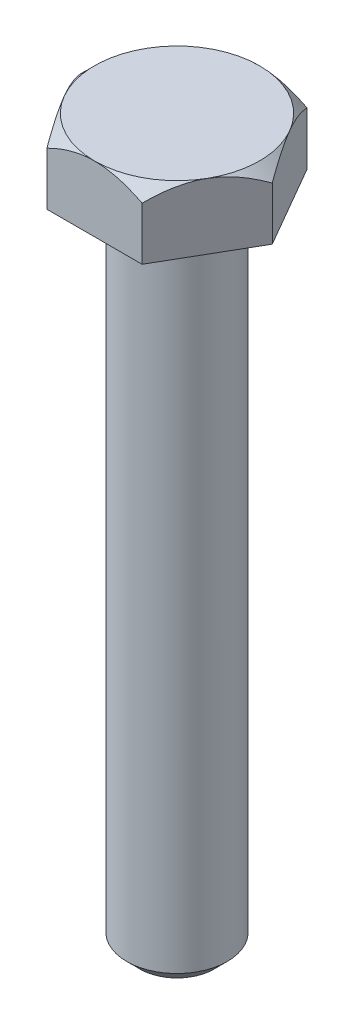
ISO-10303-21;
HEADER;
FILE_DESCRIPTION(('STEP AP214'),'2;1');
FILE_NAME('part.step','',(''),(''),'','','');
FILE_SCHEMA(('AUTOMOTIVE_DESIGN { 1 0 10303 214 1 1 1 1 }'));
ENDSEC;
DATA;
#1=APPLICATION_CONTEXT('core data for automotive mechanical design processes');
#2=APPLICATION_PROTOCOL_DEFINITION('international standard','automotive_design',2000,#1);
#3=PRODUCT_CONTEXT('',#1,'mechanical');
#4=PRODUCT('Part','Part','',(#3));
#5=PRODUCT_RELATED_PRODUCT_CATEGORY('part','',(#4));
#6=PRODUCT_DEFINITION_FORMATION('','',#4);
#7=PRODUCT_DEFINITION_CONTEXT('part definition',#1,'design');
#8=PRODUCT_DEFINITION('design','',#6,#7);
#9=PRODUCT_DEFINITION_SHAPE('','',#8);
#10=(LENGTH_UNIT() NAMED_UNIT(*) SI_UNIT(.MILLI.,.METRE.));
#11=(NAMED_UNIT(*) PLANE_ANGLE_UNIT() SI_UNIT($,.RADIAN.));
#12=(NAMED_UNIT(*) SI_UNIT($,.STERADIAN.) SOLID_ANGLE_UNIT());
#13=UNCERTAINTY_MEASURE_WITH_UNIT(LENGTH_MEASURE(1.E-05),#10,'distance_accuracy_value','');
#14=(GEOMETRIC_REPRESENTATION_CONTEXT(3) GLOBAL_UNCERTAINTY_ASSIGNED_CONTEXT((#13)) GLOBAL_UNIT_ASSIGNED_CONTEXT((#10,
#11,#12)) REPRESENTATION_CONTEXT('',''));
#15=CARTESIAN_POINT('',(0.,0.,0.));
#16=DIRECTION('',(0.,0.,1.));
#17=DIRECTION('',(1.,0.,0.));
#18=AXIS2_PLACEMENT_3D('',#15,#16,#17);
#19=CARTESIAN_POINT('',(3.62500000000007,5.,6.27868417743714));
#20=DIRECTION('',(-0.866025403784442,0.,-0.499999999999995));
#21=DIRECTION('',(-0.499999999999995,0.,0.866025403784442));
#22=AXIS2_PLACEMENT_3D('',#19,#20,#21);
#23=PLANE('',#22);
#24=CARTESIAN_POINT('',(3.62488452994624,4.02856870462476,6.27888417743714));
#25=CARTESIAN_POINT('',(3.68721389664161,4.0908916934917,6.17092654751716));
#26=CARTESIAN_POINT('',(3.75002235616352,4.15130208102734,6.06213910448007));
#27=CARTESIAN_POINT('',(3.87669145105401,4.2677158493395,5.84274179638098));
#28=CARTESIAN_POINT('',(3.94055263837515,4.32371682320785,5.73213097530909));
#29=CARTESIAN_POINT('',(4.13444955410337,4.48471046563524,5.39629166583691));
#30=CARTESIAN_POINT('',(4.26612670995196,4.58200705628878,5.16822014171098));
#31=CARTESIAN_POINT('',(4.53166422082633,4.74862075095615,4.70829568156119));
#32=CARTESIAN_POINT('',(4.66545670737727,4.81835760873348,4.47656029718399));
#33=CARTESIAN_POINT('',(4.86834501872006,4.89902600771869,4.12514743367641));
#34=CARTESIAN_POINT('',(4.93627316062514,4.92191520494596,4.00749244063306));
#35=CARTESIAN_POINT('',(5.07270459498125,4.95919667933445,3.77118626457879));
#36=CARTESIAN_POINT('',(5.14120779992591,4.97359022631844,3.65253523313333));
#37=CARTESIAN_POINT('',(5.30814078917526,4.99772308228725,3.3633988142941));
#38=CARTESIAN_POINT('',(5.40675043702598,5.0027866000747,3.19260189410018));
#39=CARTESIAN_POINT('',(5.60379200256286,4.99428769024785,2.85131589138739));
#40=CARTESIAN_POINT('',(5.70222384583931,4.98071873353769,2.68082693774991));
#41=CARTESIAN_POINT('',(5.89815953180448,4.9357547130673,2.34145637464237));
#42=CARTESIAN_POINT('',(5.99566221252046,4.9043397144273,2.17257677776813));
#43=CARTESIAN_POINT('',(6.18899174051392,4.82539152715257,1.83772021268014));
#44=CARTESIAN_POINT('',(6.28481871570106,4.77785957445157,1.67174302292037));
#45=CARTESIAN_POINT('',(6.45492849942725,4.68007191376467,1.37710423464204));
#46=CARTESIAN_POINT('',(6.52958798795453,4.63238802285783,1.2477902072457));
#47=CARTESIAN_POINT('',(6.67756674436656,4.52933616008443,0.991483482699198));
#48=CARTESIAN_POINT('',(6.75088597153632,4.47396795521828,0.864490856069481));
#49=CARTESIAN_POINT('',(6.89595327454856,4.35678861091045,0.613226916735296));
#50=CARTESIAN_POINT('',(6.96770547617939,4.29499773307909,0.488948457955774));
#51=CARTESIAN_POINT('',(7.10988123305974,4.16578428211806,0.24269282343444));
#52=CARTESIAN_POINT('',(7.18030557110013,4.09836516278837,0.120714291859081));
#53=CARTESIAN_POINT('',(7.25011547005384,4.02856870462477,-0.000200000000000499));
#54=B_SPLINE_CURVE_WITH_KNOTS('',3,(#24,#25,#26,#27,#28,#29,#30,#31,#32,#33,#34,#35,#36,#37,#38,
#39,#40,#41,#42,#43,#44,#45,#46,#47,#48,#49,#50,#51,#52,#53),.UNSPECIFIED.,.F.,.F.,(4,2,2,2,2,2,
2,2,2,2,2,2,2,2,4),(0.,0.418085081925561,0.83639681869771,1.67753646991016,2.50531966073267,
2.91839943514191,3.33141745194524,3.9223507147329,4.51349110216463,5.10529312372582,
5.69704977302065,6.16707290687592,6.63711029563191,7.10570744431351,7.57401912040438),.UNSPECIFIED.);
#55=CARTESIAN_POINT('',(3.62500000000007,4.02868417743718,6.27868417743714));
#56=VERTEX_POINT('',#55);
#57=CARTESIAN_POINT('',(5.43750000000002,5.,3.13934208871856));
#58=VERTEX_POINT('',#57);
#59=EDGE_CURVE('E110',#56,#58,#54,.T.);
#60=ORIENTED_EDGE('',*,*,#59,.F.);
#61=DIRECTION('',(0.,-1.,0.));
#62=VECTOR('',#61,1.);
#63=CARTESIAN_POINT('',(3.62500000000007,5.,6.27868417743714));
#64=LINE('',#63,#62);
#65=CARTESIAN_POINT('',(3.62500000000007,0.,6.27868417743714));
#66=VERTEX_POINT('',#65);
#67=EDGE_CURVE('E59',#56,#66,#64,.T.);
#68=ORIENTED_EDGE('',*,*,#67,.T.);
#69=DIRECTION('',(0.499999999999995,0.,-0.866025403784442));
#70=VECTOR('',#69,1.);
#71=CARTESIAN_POINT('',(3.62500000000007,0.,6.27868417743714));
#72=LINE('',#71,#70);
#73=CARTESIAN_POINT('',(7.25,0.,0.));
#74=VERTEX_POINT('',#73);
#75=EDGE_CURVE('E117',#66,#74,#72,.T.);
#76=ORIENTED_EDGE('',*,*,#75,.T.);
#77=DIRECTION('',(0.,-1.,0.));
#78=VECTOR('',#77,1.);
#79=CARTESIAN_POINT('',(7.25,5.,0.));
#80=LINE('',#79,#78);
#81=CARTESIAN_POINT('',(7.25,4.02868417743718,0.));
#82=VERTEX_POINT('',#81);
#83=EDGE_CURVE('E135',#82,#74,#80,.T.);
#84=ORIENTED_EDGE('',*,*,#83,.F.);
#85=EDGE_CURVE('E118',#58,#82,#54,.T.);
#86=ORIENTED_EDGE('',*,*,#85,.F.);
#87=EDGE_LOOP('',(#60,#68,#76,#84,#86));
#88=FACE_BOUND('',#87,.T.);
#89=ADVANCED_FACE('F36',(#88),#23,.F.);
#90=CARTESIAN_POINT('',(7.25,5.,0.));
#91=DIRECTION('',(-0.866025403784438,0.,0.500000000000001));
#92=DIRECTION('',(0.500000000000001,0.,0.866025403784438));
#93=AXIS2_PLACEMENT_3D('',#90,#91,#92);
#94=PLANE('',#93);
#95=CARTESIAN_POINT('',(7.25011547005384,4.02856870462477,0.000200000000000034));
#96=CARTESIAN_POINT('',(7.18778610335847,4.0908916934917,-0.107757629919975));
#97=CARTESIAN_POINT('',(7.12497764383655,4.15130208102734,-0.21654507295707));
#98=CARTESIAN_POINT('',(6.99830854894606,4.2677158493395,-0.435942381056166));
#99=CARTESIAN_POINT('',(6.93444736162492,4.32371682320785,-0.546553202128054));
#100=CARTESIAN_POINT('',(6.7405504458967,4.48471046563526,-0.882392511600232));
#101=CARTESIAN_POINT('',(6.6088732900481,4.58200705628879,-1.11046403572617));
#102=CARTESIAN_POINT('',(6.34333577917372,4.74862075095617,-1.57038849587596));
#103=CARTESIAN_POINT('',(6.20954329262278,4.8183576087335,-1.80212388025316));
#104=CARTESIAN_POINT('',(6.00665498127998,4.89902600771871,-2.15353674376074));
#105=CARTESIAN_POINT('',(5.9387268393749,4.92191520494598,-2.27119173680409));
#106=CARTESIAN_POINT('',(5.80229540501879,4.95919667933447,-2.50749791285837));
#107=CARTESIAN_POINT('',(5.73379220007413,4.97359022631846,-2.62614894430383));
#108=CARTESIAN_POINT('',(5.56685921082478,4.99772308228727,-2.91528536314305));
#109=CARTESIAN_POINT('',(5.46824956297406,5.00278660007473,-3.08608228333698));
#110=CARTESIAN_POINT('',(5.27120799743718,4.99428769024788,-3.42736828604976));
#111=CARTESIAN_POINT('',(5.17277615416072,4.98071873353772,-3.59785723968724));
#112=CARTESIAN_POINT('',(4.97684046819555,4.93575471306732,-3.93722780279478));
#113=CARTESIAN_POINT('',(4.87933778747957,4.90433971442733,-4.10610739966901));
#114=CARTESIAN_POINT('',(4.68600825948611,4.8253915271526,-4.44096396475701));
#115=CARTESIAN_POINT('',(4.59018128429897,4.7778595744516,-4.60694115451677));
#116=CARTESIAN_POINT('',(4.42007150057277,4.68007191376469,-4.9015799427951));
#117=CARTESIAN_POINT('',(4.34541201204549,4.63238802285786,-5.03089397019145));
#118=CARTESIAN_POINT('',(4.19743325563346,4.52933616008445,-5.28720069473796));
#119=CARTESIAN_POINT('',(4.12411402846369,4.4739679552183,-5.41419332136768));
#120=CARTESIAN_POINT('',(3.97904672545145,4.35678861091046,-5.66545726070187));
#121=CARTESIAN_POINT('',(3.90729452382061,4.2949977330791,-5.7897357194814));
#122=CARTESIAN_POINT('',(3.76511876694025,4.16578428211807,-6.03599135400274));
#123=CARTESIAN_POINT('',(3.69469442889986,4.09836516278837,-6.1579698855781));
#124=CARTESIAN_POINT('',(3.62488452994615,4.02856870462476,-6.27888417743719));
#125=B_SPLINE_CURVE_WITH_KNOTS('',3,(#95,#96,#97,#98,#99,#100,#101,#102,#103,#104,#105,#106,
#107,#108,#109,#110,#111,#112,#113,#114,#115,#116,#117,#118,#119,#120,#121,#122,#123,#124),
.UNSPECIFIED.,.F.,.F.,(4,2,2,2,2,2,2,2,2,2,2,2,2,2,4),(0.,0.418085081925567,0.83639681869772,
1.67753646991019,2.5053196607327,2.91839943514195,3.33141745194528,3.92235071473293,
4.51349110216466,5.10529312372585,5.69704977302068,6.16707290687597,6.63711029563198,
7.1057074443136,7.57401912040448),.UNSPECIFIED.);
#126=CARTESIAN_POINT('',(5.43749999999999,5.,-3.13934208871859));
#127=VERTEX_POINT('',#126);
#128=EDGE_CURVE('E125',#82,#127,#125,.T.);
#129=ORIENTED_EDGE('',*,*,#128,.F.);
#130=ORIENTED_EDGE('',*,*,#83,.T.);
#131=DIRECTION('',(-0.500000000000001,0.,-0.866025403784438));
#132=VECTOR('',#131,1.);
#133=CARTESIAN_POINT('',(7.25,0.,0.));
#134=LINE('',#133,#132);
#135=CARTESIAN_POINT('',(3.62499999999999,0.,-6.27868417743719));
#136=VERTEX_POINT('',#135);
#137=EDGE_CURVE('E398',#74,#136,#134,.T.);
#138=ORIENTED_EDGE('',*,*,#137,.T.);
#139=DIRECTION('',(0.,-1.,0.));
#140=VECTOR('',#139,1.);
#141=CARTESIAN_POINT('',(3.62499999999999,5.,-6.27868417743719));
#142=LINE('',#141,#140);
#143=CARTESIAN_POINT('',(3.62499999999999,4.02868417743718,-6.27868417743719));
#144=VERTEX_POINT('',#143);
#145=EDGE_CURVE('E204',#144,#136,#142,.T.);
#146=ORIENTED_EDGE('',*,*,#145,.F.);
#147=EDGE_CURVE('E136',#127,#144,#125,.T.);
#148=ORIENTED_EDGE('',*,*,#147,.F.);
#149=EDGE_LOOP('',(#129,#130,#138,#146,#148));
#150=FACE_BOUND('',#149,.T.);
#151=ADVANCED_FACE('F192',(#150),#94,.F.);
#152=CARTESIAN_POINT('',(3.62499999999999,5.,-6.27868417743719));
#153=DIRECTION('',(0.,0.,1.));
#154=DIRECTION('',(1.,0.,0.));
#155=AXIS2_PLACEMENT_3D('',#152,#153,#154);
#156=PLANE('',#155);
#157=CARTESIAN_POINT('',(-7.57666051860033,1.43857952280487,-6.27868417743715));
#158=CARTESIAN_POINT('',(-7.39365651230783,1.57945688959872,-6.27868417743715));
#159=CARTESIAN_POINT('',(-7.20966776392706,1.71907512434262,-6.27868417743715));
#160=CARTESIAN_POINT('',(-6.83931781583867,1.99521769306877,-6.27868417743715));
#161=CARTESIAN_POINT('',(-6.65295606622731,2.13174128876494,-6.27868417743715));
#162=CARTESIAN_POINT('',(-6.27609540777261,2.40209046760801,-6.27868417743715));
#163=CARTESIAN_POINT('',(-6.08557567548029,2.53588711812094,-6.27868417743715));
#164=CARTESIAN_POINT('',(-5.7013676758548,2.79883528544532,-6.27868417743716));
#165=CARTESIAN_POINT('',(-5.50767962786199,2.92798712185071,-6.27868417743716));
#166=CARTESIAN_POINT('',(-5.10415932230891,3.18862292545138,-6.27868417743716));
#167=CARTESIAN_POINT('',(-4.89408397797518,3.31973242959604,-6.27868417743716));
#168=CARTESIAN_POINT('',(-4.46899924146733,3.57382963916996,-6.27868417743716));
#169=CARTESIAN_POINT('',(-4.25398902548427,3.69681597506302,-6.27868417743716));
#170=CARTESIAN_POINT('',(-3.81897305439861,3.93204888921299,-6.27868417743716));
#171=CARTESIAN_POINT('',(-3.59898447967616,4.04432699068524,-6.27868417743716));
#172=CARTESIAN_POINT('',(-3.15278127156474,4.25562782816849,-6.27868417743717));
#173=CARTESIAN_POINT('',(-2.92656964053751,4.35465682564157,-6.27868417743717));
#174=CARTESIAN_POINT('',(-2.49021164331831,4.52687246842811,-6.27868417743717));
#175=CARTESIAN_POINT('',(-2.28069897147736,4.60164844585029,-6.27868417743717));
#176=CARTESIAN_POINT('',(-1.85632597962451,4.73443118921241,-6.27868417743717));
#177=CARTESIAN_POINT('',(-1.64146532079161,4.79243688972169,-6.27868417743717));
#178=CARTESIAN_POINT('',(-1.21142765694939,4.8875683886695,-6.27868417743717));
#179=CARTESIAN_POINT('',(-0.996336148218653,4.9250741683904,-6.27868417743717));
#180=CARTESIAN_POINT('',(-0.56346815275014,4.97842167925469,-6.27868417743717));
#181=CARTESIAN_POINT('',(-0.345692236177016,4.99426793349426,-6.27868417743717));
#182=CARTESIAN_POINT('',(0.0807362217716663,5.0029407360174,-6.27868417743718));
#183=CARTESIAN_POINT('',(0.289368982497101,4.99674859993676,-6.27868417743718));
#184=CARTESIAN_POINT('',(0.705011615215947,4.96394190845027,-6.27868417743718));
#185=CARTESIAN_POINT('',(0.912021338466265,4.9373255028629,-6.27868417743718));
#186=CARTESIAN_POINT('',(1.3264284221839,4.86472465401487,-6.27868417743718));
#187=CARTESIAN_POINT('',(1.53376477368789,4.81839783409703,-6.27868417743718));
#188=CARTESIAN_POINT('',(1.94386969783723,4.70894974197332,-6.27868417743718));
#189=CARTESIAN_POINT('',(2.14663852486609,4.64582940758558,-6.27868417743718));
#190=CARTESIAN_POINT('',(2.55855272468635,4.5016094654899,-6.27868417743719));
#191=CARTESIAN_POINT('',(2.76740928890636,4.41969434988626,-6.27868417743719));
#192=CARTESIAN_POINT('',(3.17975166734441,4.24320663783212,-6.27868417743719));
#193=CARTESIAN_POINT('',(3.38323501259331,4.14862833983322,-6.27868417743719));
#194=CARTESIAN_POINT('',(3.78579095692702,3.94905699505205,-6.27868417743719));
#195=CARTESIAN_POINT('',(3.98484753290937,3.84403189037483,-6.27868417743719));
#196=CARTESIAN_POINT('',(4.37839993765141,3.62587782327072,-6.27868417743719));
#197=CARTESIAN_POINT('',(4.57289646186356,3.51275010738356,-6.27868417743719));
#198=CARTESIAN_POINT('',(4.94842033299621,3.28571869098054,-6.27868417743719));
#199=CARTESIAN_POINT('',(5.12963857253774,3.17212907012057,-6.27868417743719));
#200=CARTESIAN_POINT('',(5.48896153359933,2.94011331347926,-6.2786841774372));
#201=CARTESIAN_POINT('',(5.66706602033122,2.82168681520702,-6.2786841774372));
#202=CARTESIAN_POINT('',(6.01913728036014,2.5818234603211,-6.2786841774372));
#203=CARTESIAN_POINT('',(6.19312579011556,2.46041839375126,-6.2786841774372));
#204=CARTESIAN_POINT('',(6.5387156854476,2.2143526316317,-6.2786841774372));
#205=CARTESIAN_POINT('',(6.71031771587599,2.08969284280949,-6.2786841774372));
#206=CARTESIAN_POINT('',(6.88091860823282,1.96370076934005,-6.2786841774372));
#207=B_SPLINE_CURVE_WITH_KNOTS('',3,(#157,#158,#159,#160,#161,#162,#163,#164,#165,#166,#167,
#168,#169,#170,#171,#172,#173,#174,#175,#176,#177,#178,#179,#180,#181,#182,#183,#184,#185,#186,
#187,#188,#189,#190,#191,#192,#193,#194,#195,#196,#197,#198,#199,#200,#201,#202,#203,#204,#205,
#206),.UNSPECIFIED.,.F.,.F.,(4,2,2,2,2,2,2,2,2,2,2,2,2,2,2,2,2,2,2,2,2,2,2,2,4),(0.,
0.692856158772512,1.38587590819399,2.0842410666755,2.78255808072084,3.52530650890354,
4.26817984375935,5.00879403011467,5.74905696003691,6.41585238613356,7.08269016503529,
7.73670784074358,8.39058891895184,9.01572562815278,9.64091897355062,10.2774464921539,
10.9139384719306,11.586461232698,12.2592878189047,12.9342468231889,13.6091022110665,
14.2506381722582,14.8922223007264,15.5286570401769,16.1649163294069),.UNSPECIFIED.);
#208=CARTESIAN_POINT('',(0.,5.,-6.27868417743718));
#209=VERTEX_POINT('',#208);
#210=EDGE_CURVE('E186',#144,#209,#207,.F.);
#211=ORIENTED_EDGE('',*,*,#210,.F.);
#212=ORIENTED_EDGE('',*,*,#145,.T.);
#213=DIRECTION('',(-1.,0.,0.));
#214=VECTOR('',#213,1.);
#215=CARTESIAN_POINT('',(3.62499999999999,0.,-6.27868417743719));
#216=LINE('',#215,#214);
#217=CARTESIAN_POINT('',(-3.62500000000003,0.,-6.27868417743716));
#218=VERTEX_POINT('',#217);
#219=EDGE_CURVE('E222',#136,#218,#216,.T.);
#220=ORIENTED_EDGE('',*,*,#219,.T.);
#221=DIRECTION('',(0.,-1.,0.));
#222=VECTOR('',#221,1.);
#223=CARTESIAN_POINT('',(-3.62500000000003,5.,-6.27868417743716));
#224=LINE('',#223,#222);
#225=CARTESIAN_POINT('',(-3.62500000000003,4.02868417743718,-6.27868417743716));
#226=VERTEX_POINT('',#225);
#227=EDGE_CURVE('E220',#226,#218,#224,.T.);
#228=ORIENTED_EDGE('',*,*,#227,.F.);
#229=EDGE_CURVE('E181',#209,#226,#207,.F.);
#230=ORIENTED_EDGE('',*,*,#229,.F.);
#231=EDGE_LOOP('',(#211,#212,#220,#228,#230));
#232=FACE_BOUND('',#231,.T.);
#233=ADVANCED_FACE('F188',(#232),#156,.F.);
#234=CARTESIAN_POINT('',(-3.62500000000003,5.,-6.27868417743716));
#235=DIRECTION('',(0.866025403784442,0.,0.499999999999995));
#236=DIRECTION('',(0.499999999999995,0.,-0.866025403784442));
#237=AXIS2_PLACEMENT_3D('',#234,#235,#236);
#238=PLANE('',#237);
#239=CARTESIAN_POINT('',(-3.62488452994619,4.02856870462477,-6.27888417743716));
#240=CARTESIAN_POINT('',(-3.68721389664156,4.0908916934917,-6.17092654751719));
#241=CARTESIAN_POINT('',(-3.75002235616348,4.15130208102734,-6.06213910448009));
#242=CARTESIAN_POINT('',(-3.87669145105397,4.2677158493395,-5.842741796381));
#243=CARTESIAN_POINT('',(-3.94055263837511,4.32371682320785,-5.73213097530911));
#244=CARTESIAN_POINT('',(-4.13444955410333,4.48471046563526,-5.39629166583693));
#245=CARTESIAN_POINT('',(-4.26612670995192,4.58200705628879,-5.16822014171099));
#246=CARTESIAN_POINT('',(-4.5316642208263,4.74862075095617,-4.7082956815612));
#247=CARTESIAN_POINT('',(-4.66545670737723,4.8183576087335,-4.476560297184));
#248=CARTESIAN_POINT('',(-4.86834501872003,4.89902600771871,-4.12514743367642));
#249=CARTESIAN_POINT('',(-4.93627316062511,4.92191520494598,-4.00749244063306));
#250=CARTESIAN_POINT('',(-5.07270459498122,4.95919667933447,-3.77118626457879));
#251=CARTESIAN_POINT('',(-5.14120779992588,4.97359022631847,-3.65253523313333));
#252=CARTESIAN_POINT('',(-5.30814078917523,4.99772308228727,-3.3633988142941));
#253=CARTESIAN_POINT('',(-5.40675043702595,5.00278660007473,-3.19260189410018));
#254=CARTESIAN_POINT('',(-5.60379200256283,4.99428769024788,-2.85131589138739));
#255=CARTESIAN_POINT('',(-5.70222384583928,4.98071873353772,-2.68082693774991));
#256=CARTESIAN_POINT('',(-5.89815953180445,4.93575471306732,-2.34145637464237));
#257=CARTESIAN_POINT('',(-5.99566221252043,4.90433971442733,-2.17257677776813));
#258=CARTESIAN_POINT('',(-6.18899174051389,4.8253915271526,-1.83772021268014));
#259=CARTESIAN_POINT('',(-6.28481871570103,4.7778595744516,-1.67174302292038));
#260=CARTESIAN_POINT('',(-6.45492849942722,4.68007191376469,-1.37710423464204));
#261=CARTESIAN_POINT('',(-6.5295879879545,4.63238802285786,-1.24779020724569));
#262=CARTESIAN_POINT('',(-6.67756674436654,4.52933616008446,-0.991483482699183));
#263=CARTESIAN_POINT('',(-6.7508859715363,4.4739679552183,-0.864490856069462));
#264=CARTESIAN_POINT('',(-6.89595327454855,4.35678861091046,-0.613226916735267));
#265=CARTESIAN_POINT('',(-6.96770547617938,4.2949977330791,-0.488948457955741));
#266=CARTESIAN_POINT('',(-7.10988123305973,4.16578428211807,-0.242692823434398));
#267=CARTESIAN_POINT('',(-7.18030557110012,4.09836516278837,-0.120714291859035));
#268=CARTESIAN_POINT('',(-7.25011547005384,4.02856870462476,0.000200000000050344));
#269=B_SPLINE_CURVE_WITH_KNOTS('',3,(#239,#240,#241,#242,#243,#244,#245,#246,#247,#248,#249,
#250,#251,#252,#253,#254,#255,#256,#257,#258,#259,#260,#261,#262,#263,#264,#265,#266,#267,#268),
.UNSPECIFIED.,.F.,.F.,(4,2,2,2,2,2,2,2,2,2,2,2,2,2,4),(0.,0.418085081925566,0.836396818697719,
1.67753646991018,2.5053196607327,2.91839943514195,3.33141745194527,3.92235071473293,
4.51349110216466,5.10529312372584,5.69704977302067,6.16707290687597,6.63711029563198,
7.1057074443136,7.57401912040448),.UNSPECIFIED.);
#270=CARTESIAN_POINT('',(-5.43750000000001,5.,-3.13934208871856));
#271=VERTEX_POINT('',#270);
#272=EDGE_CURVE('E187',#226,#271,#269,.T.);
#273=ORIENTED_EDGE('',*,*,#272,.F.);
#274=ORIENTED_EDGE('',*,*,#227,.T.);
#275=DIRECTION('',(-0.499999999999995,0.,0.866025403784441));
#276=VECTOR('',#275,1.);
#277=CARTESIAN_POINT('',(-3.62500000000003,0.,-6.27868417743716));
#278=LINE('',#277,#276);
#279=CARTESIAN_POINT('',(-7.25,0.,0.));
#280=VERTEX_POINT('',#279);
#281=EDGE_CURVE('E396',#218,#280,#278,.T.);
#282=ORIENTED_EDGE('',*,*,#281,.T.);
#283=DIRECTION('',(0.,-1.,0.));
#284=VECTOR('',#283,1.);
#285=CARTESIAN_POINT('',(-7.25,5.,0.));
#286=LINE('',#285,#284);
#287=CARTESIAN_POINT('',(-7.25,4.02868417743718,0.));
#288=VERTEX_POINT('',#287);
#289=EDGE_CURVE('E226',#288,#280,#286,.T.);
#290=ORIENTED_EDGE('',*,*,#289,.F.);
#291=EDGE_CURVE('E176',#271,#288,#269,.T.);
#292=ORIENTED_EDGE('',*,*,#291,.F.);
#293=EDGE_LOOP('',(#273,#274,#282,#290,#292));
#294=FACE_BOUND('',#293,.T.);
#295=ADVANCED_FACE('F191',(#294),#238,.F.);
#296=CARTESIAN_POINT('',(-7.25,5.,0.));
#297=DIRECTION('',(0.866025403784435,0.,-0.500000000000007));
#298=DIRECTION('',(-0.500000000000007,0.,-0.866025403784435));
#299=AXIS2_PLACEMENT_3D('',#296,#297,#298);
#300=PLANE('',#299);
#301=CARTESIAN_POINT('',(-7.25011547005384,4.02856870462477,-0.000199999999949406));
#302=CARTESIAN_POINT('',(-7.18778610335847,4.0908916934917,0.107757629920025));
#303=CARTESIAN_POINT('',(-7.12497764383655,4.15130208102734,0.216545072957119));
#304=CARTESIAN_POINT('',(-6.99830854894605,4.2677158493395,0.435942381056215));
#305=CARTESIAN_POINT('',(-6.93444736162491,4.32371682320785,0.546553202128102));
#306=CARTESIAN_POINT('',(-6.74055044589669,4.48471046563525,0.882392511600279));
#307=CARTESIAN_POINT('',(-6.60887329004809,4.58200705628879,1.11046403572621));
#308=CARTESIAN_POINT('',(-6.34333577917371,4.74862075095617,1.570388495876));
#309=CARTESIAN_POINT('',(-6.20954329262277,4.8183576087335,1.8021238802532));
#310=CARTESIAN_POINT('',(-6.00665498127997,4.89902600771871,2.15353674376078));
#311=CARTESIAN_POINT('',(-5.93872683937489,4.92191520494598,2.27119173680413));
#312=CARTESIAN_POINT('',(-5.80229540501878,4.95919667933447,2.50749791285841));
#313=CARTESIAN_POINT('',(-5.73379220007411,4.97359022631847,2.62614894430387));
#314=CARTESIAN_POINT('',(-5.56685921082476,4.99772308228727,2.91528536314309));
#315=CARTESIAN_POINT('',(-5.46824956297404,5.00278660007473,3.08608228333701));
#316=CARTESIAN_POINT('',(-5.27120799743715,4.99428769024788,3.4273682860498));
#317=CARTESIAN_POINT('',(-5.1727761541607,4.98071873353772,3.59785723968728));
#318=CARTESIAN_POINT('',(-4.97684046819552,4.93575471306732,3.93722780279481));
#319=CARTESIAN_POINT('',(-4.87933778747955,4.90433971442733,4.10610739966905));
#320=CARTESIAN_POINT('',(-4.68600825948608,4.8253915271526,4.44096396475704));
#321=CARTESIAN_POINT('',(-4.59018128429894,4.7778595744516,4.6069411545168));
#322=CARTESIAN_POINT('',(-4.42007150057274,4.68007191376469,4.90157994279513));
#323=CARTESIAN_POINT('',(-4.34541201204546,4.63238802285786,5.03089397019148));
#324=CARTESIAN_POINT('',(-4.19743325563342,4.52933616008446,5.28720069473799));
#325=CARTESIAN_POINT('',(-4.12411402846365,4.4739679552183,5.41419332136771));
#326=CARTESIAN_POINT('',(-3.9790467254514,4.35678861091047,5.6654572607019));
#327=CARTESIAN_POINT('',(-3.90729452382057,4.2949977330791,5.78973571948143));
#328=CARTESIAN_POINT('',(-3.76511876694021,4.16578428211807,6.03599135400277));
#329=CARTESIAN_POINT('',(-3.69469442889982,4.09836516278837,6.15796988557813));
#330=CARTESIAN_POINT('',(-3.6248845299461,4.02856870462477,6.27888417743721));
#331=B_SPLINE_CURVE_WITH_KNOTS('',3,(#301,#302,#303,#304,#305,#306,#307,#308,#309,#310,#311,
#312,#313,#314,#315,#316,#317,#318,#319,#320,#321,#322,#323,#324,#325,#326,#327,#328,#329,#330),
.UNSPECIFIED.,.F.,.F.,(4,2,2,2,2,2,2,2,2,2,2,2,2,2,4),(0.,0.418085081925566,0.836396818697719,
1.67753646991019,2.50531966073269,2.91839943514195,3.33141745194527,3.92235071473293,
4.51349110216466,5.10529312372585,5.69704977302068,6.16707290687597,6.63711029563198,
7.1057074443136,7.57401912040449),.UNSPECIFIED.);
#332=CARTESIAN_POINT('',(-5.43749999999997,5.,3.13934208871863));
#333=VERTEX_POINT('',#332);
#334=EDGE_CURVE('E381',#288,#333,#331,.T.);
#335=ORIENTED_EDGE('',*,*,#334,.F.);
#336=ORIENTED_EDGE('',*,*,#289,.T.);
#337=DIRECTION('',(0.500000000000007,0.,0.866025403784434));
#338=VECTOR('',#337,1.);
#339=CARTESIAN_POINT('',(-7.25,0.,0.));
#340=LINE('',#339,#338);
#341=CARTESIAN_POINT('',(-3.62499999999994,0.,6.27868417743721));
#342=VERTEX_POINT('',#341);
#343=EDGE_CURVE('E389',#280,#342,#340,.T.);
#344=ORIENTED_EDGE('',*,*,#343,.T.);
#345=DIRECTION('',(0.,-1.,0.));
#346=VECTOR('',#345,1.);
#347=CARTESIAN_POINT('',(-3.62499999999994,5.,6.27868417743721));
#348=LINE('',#347,#346);
#349=CARTESIAN_POINT('',(-3.62499999999994,4.02868417743718,6.27868417743721));
#350=VERTEX_POINT('',#349);
#351=EDGE_CURVE('E229',#350,#342,#348,.T.);
#352=ORIENTED_EDGE('',*,*,#351,.F.);
#353=EDGE_CURVE('E169',#333,#350,#331,.T.);
#354=ORIENTED_EDGE('',*,*,#353,.F.);
#355=EDGE_LOOP('',(#335,#336,#344,#352,#354));
#356=FACE_BOUND('',#355,.T.);
#357=ADVANCED_FACE('F309',(#356),#300,.F.);
#358=CARTESIAN_POINT('',(-3.62499999999994,5.,6.27868417743721));
#359=DIRECTION('',(0.,0.,-1.));
#360=DIRECTION('',(-1.,0.,0.));
#361=AXIS2_PLACEMENT_3D('',#358,#359,#360);
#362=PLANE('',#361);
#363=CARTESIAN_POINT('',(-7.57666051860024,1.43857952280487,6.27868417743725));
#364=CARTESIAN_POINT('',(-7.39365651230774,1.57945688959872,6.27868417743725));
#365=CARTESIAN_POINT('',(-7.20966776392697,1.71907512434262,6.27868417743725));
#366=CARTESIAN_POINT('',(-6.83931781583858,1.99521769306878,6.27868417743725));
#367=CARTESIAN_POINT('',(-6.65295606622722,2.13174128876494,6.27868417743725));
#368=CARTESIAN_POINT('',(-6.27609540777252,2.40209046760801,6.27868417743724));
#369=CARTESIAN_POINT('',(-6.0855756754802,2.53588711812094,6.27868417743724));
#370=CARTESIAN_POINT('',(-5.70136767585471,2.79883528544532,6.27868417743724));
#371=CARTESIAN_POINT('',(-5.50767962786191,2.92798712185071,6.27868417743723));
#372=CARTESIAN_POINT('',(-5.10415932230883,3.18862292545138,6.27868417743723));
#373=CARTESIAN_POINT('',(-4.89408397797509,3.31973242959604,6.27868417743723));
#374=CARTESIAN_POINT('',(-4.46899924146725,3.57382963916996,6.27868417743722));
#375=CARTESIAN_POINT('',(-4.25398902548418,3.69681597506302,6.27868417743722));
#376=CARTESIAN_POINT('',(-3.81897305439853,3.93204888921299,6.27868417743722));
#377=CARTESIAN_POINT('',(-3.59898447967608,4.04432699068524,6.27868417743721));
#378=CARTESIAN_POINT('',(-3.15278127156466,4.25562782816848,6.27868417743721));
#379=CARTESIAN_POINT('',(-2.92656964053743,4.35465682564157,6.27868417743721));
#380=CARTESIAN_POINT('',(-2.49021164331822,4.52687246842811,6.2786841774372));
#381=CARTESIAN_POINT('',(-2.28069897147728,4.60164844585029,6.2786841774372));
#382=CARTESIAN_POINT('',(-1.85632597962443,4.73443118921241,6.2786841774372));
#383=CARTESIAN_POINT('',(-1.64146532079152,4.79243688972169,6.27868417743719));
#384=CARTESIAN_POINT('',(-1.2114276569493,4.8875683886695,6.27868417743719));
#385=CARTESIAN_POINT('',(-0.996336148218567,4.9250741683904,6.27868417743719));
#386=CARTESIAN_POINT('',(-0.563468152750053,4.97842167925468,6.27868417743718));
#387=CARTESIAN_POINT('',(-0.345692236176929,4.99426793349426,6.27868417743718));
#388=CARTESIAN_POINT('',(0.0807362217717539,5.00294073601741,6.27868417743718));
#389=CARTESIAN_POINT('',(0.289368982497189,4.99674859993676,6.27868417743717));
#390=CARTESIAN_POINT('',(0.705011615216036,4.96394190845027,6.27868417743717));
#391=CARTESIAN_POINT('',(0.912021338466354,4.9373255028629,6.27868417743717));
#392=CARTESIAN_POINT('',(1.32642842218399,4.86472465401487,6.27868417743716));
#393=CARTESIAN_POINT('',(1.53376477368798,4.81839783409703,6.27868417743716));
#394=CARTESIAN_POINT('',(1.94386969783732,4.70894974197332,6.27868417743716));
#395=CARTESIAN_POINT('',(2.14663852486618,4.64582940758559,6.27868417743715));
#396=CARTESIAN_POINT('',(2.55855272468644,4.5016094654899,6.27868417743715));
#397=CARTESIAN_POINT('',(2.76740928890645,4.41969434988626,6.27868417743715));
#398=CARTESIAN_POINT('',(3.1797516673445,4.24320663783212,6.27868417743714));
#399=CARTESIAN_POINT('',(3.3832350125934,4.14862833983321,6.27868417743714));
#400=CARTESIAN_POINT('',(3.78579095692711,3.94905699505205,6.27868417743714));
#401=CARTESIAN_POINT('',(3.98484753290946,3.84403189037483,6.27868417743714));
#402=CARTESIAN_POINT('',(4.3783999376515,3.62587782327071,6.27868417743713));
#403=CARTESIAN_POINT('',(4.57289646186365,3.51275010738355,6.27868417743713));
#404=CARTESIAN_POINT('',(4.9484203329963,3.28571869098054,6.27868417743713));
#405=CARTESIAN_POINT('',(5.12963857253784,3.17212907012056,6.27868417743712));
#406=CARTESIAN_POINT('',(5.48896153359942,2.94011331347926,6.27868417743712));
#407=CARTESIAN_POINT('',(5.66706602033131,2.82168681520701,6.27868417743712));
#408=CARTESIAN_POINT('',(6.01913728036024,2.58182346032109,6.27868417743711));
#409=CARTESIAN_POINT('',(6.19312579011566,2.46041839375125,6.27868417743711));
#410=CARTESIAN_POINT('',(6.5387156854477,2.21435263163169,6.27868417743711));
#411=CARTESIAN_POINT('',(6.71031771587608,2.08969284280948,6.27868417743711));
#412=CARTESIAN_POINT('',(6.88091860823291,1.96370076934005,6.27868417743711));
#413=B_SPLINE_CURVE_WITH_KNOTS('',3,(#363,#364,#365,#366,#367,#368,#369,#370,#371,#372,#373,
#374,#375,#376,#377,#378,#379,#380,#381,#382,#383,#384,#385,#386,#387,#388,#389,#390,#391,#392,
#393,#394,#395,#396,#397,#398,#399,#400,#401,#402,#403,#404,#405,#406,#407,#408,#409,#410,#411,
#412),.UNSPECIFIED.,.F.,.F.,(4,2,2,2,2,2,2,2,2,2,2,2,2,2,2,2,2,2,2,2,2,2,2,2,4),(0.,
0.692856158772512,1.38587590819398,2.0842410666755,2.78255808072084,3.52530650890354,
4.26817984375935,5.00879403011467,5.7490569600369,6.41585238613355,7.08269016503529,
7.73670784074358,8.39058891895183,9.01572562815278,9.64091897355062,10.2774464921539,
10.9139384719306,11.586461232698,12.2592878189047,12.9342468231889,13.6091022110665,
14.2506381722582,14.8922223007265,15.5286570401769,16.1649163294069),.UNSPECIFIED.);
#414=CARTESIAN_POINT('',(0.,5.,6.27868417743717));
#415=VERTEX_POINT('',#414);
#416=EDGE_CURVE('E383',#350,#415,#413,.T.);
#417=ORIENTED_EDGE('',*,*,#416,.F.);
#418=ORIENTED_EDGE('',*,*,#351,.T.);
#419=DIRECTION('',(1.,0.,0.));
#420=VECTOR('',#419,1.);
#421=CARTESIAN_POINT('',(-3.62499999999994,0.,6.27868417743721));
#422=LINE('',#421,#420);
#423=EDGE_CURVE('E391',#342,#66,#422,.T.);
#424=ORIENTED_EDGE('',*,*,#423,.T.);
#425=ORIENTED_EDGE('',*,*,#67,.F.);
#426=EDGE_CURVE('E115',#415,#56,#413,.T.);
#427=ORIENTED_EDGE('',*,*,#426,.F.);
#428=EDGE_LOOP('',(#417,#418,#424,#425,#427));
#429=FACE_BOUND('',#428,.T.);
#430=ADVANCED_FACE('F302',(#429),#362,.F.);
#431=CARTESIAN_POINT('',(0.,0.,0.));
#432=DIRECTION('',(0.,1.,0.));
#433=DIRECTION('',(0.,0.,1.));
#434=AXIS2_PLACEMENT_3D('',#431,#432,#433);
#435=PLANE('',#434);
#436=CARTESIAN_POINT('',(0.,0.,0.));
#437=DIRECTION('',(0.,1.,0.));
#438=DIRECTION('',(0.,0.,1.));
#439=AXIS2_PLACEMENT_3D('',#436,#437,#438);
#440=CIRCLE('',#439,4.825);
#441=CARTESIAN_POINT('',(0.,0.,4.825));
#442=VERTEX_POINT('',#441);
#443=EDGE_CURVE('E236',#442,#442,#440,.T.);
#444=ORIENTED_EDGE('',*,*,#443,.T.);
#445=EDGE_LOOP('',(#444));
#446=FACE_BOUND('',#445,.T.);
#447=ORIENTED_EDGE('',*,*,#75,.F.);
#448=ORIENTED_EDGE('',*,*,#423,.F.);
#449=ORIENTED_EDGE('',*,*,#343,.F.);
#450=ORIENTED_EDGE('',*,*,#281,.F.);
#451=ORIENTED_EDGE('',*,*,#219,.F.);
#452=ORIENTED_EDGE('',*,*,#137,.F.);
#453=EDGE_LOOP('',(#447,#448,#449,#450,#451,#452));
#454=FACE_BOUND('',#453,.T.);
#455=ADVANCED_FACE('F295',(#446,#454),#435,.F.);
#456=CARTESIAN_POINT('',(0.,5.,0.));
#457=DIRECTION('',(0.,-1.,0.));
#458=DIRECTION('',(0.,0.,1.));
#459=AXIS2_PLACEMENT_3D('',#456,#457,#458);
#460=CONICAL_SURFACE('',#459,6.27868417743718,0.78539816339745);
#461=ORIENTED_EDGE('',*,*,#353,.T.);
#462=ORIENTED_EDGE('',*,*,#416,.T.);
#463=CARTESIAN_POINT('',(0.,5.,0.));
#464=DIRECTION('',(0.,1.,0.));
#465=DIRECTION('',(0.,0.,1.));
#466=AXIS2_PLACEMENT_3D('',#463,#464,#465);
#467=CIRCLE('',#466,6.27868417743718);
#468=EDGE_CURVE('E51',#333,#415,#467,.T.);
#469=ORIENTED_EDGE('',*,*,#468,.F.);
#470=EDGE_LOOP('',(#461,#462,#469));
#471=FACE_BOUND('',#470,.T.);
#472=ADVANCED_FACE('F155',(#471),#460,.T.);
#473=ORIENTED_EDGE('',*,*,#291,.T.);
#474=ORIENTED_EDGE('',*,*,#334,.T.);
#475=EDGE_CURVE('E217',#271,#333,#467,.T.);
#476=ORIENTED_EDGE('',*,*,#475,.F.);
#477=EDGE_LOOP('',(#473,#474,#476));
#478=FACE_BOUND('',#477,.T.);
#479=ADVANCED_FACE('F283',(#478),#460,.T.);
#480=ORIENTED_EDGE('',*,*,#229,.T.);
#481=ORIENTED_EDGE('',*,*,#272,.T.);
#482=EDGE_CURVE('E212',#209,#271,#467,.T.);
#483=ORIENTED_EDGE('',*,*,#482,.F.);
#484=EDGE_LOOP('',(#480,#481,#483));
#485=FACE_BOUND('',#484,.T.);
#486=ADVANCED_FACE('F213',(#485),#460,.T.);
#487=ORIENTED_EDGE('',*,*,#147,.T.);
#488=ORIENTED_EDGE('',*,*,#210,.T.);
#489=EDGE_CURVE('E130',#127,#209,#467,.T.);
#490=ORIENTED_EDGE('',*,*,#489,.F.);
#491=EDGE_LOOP('',(#487,#488,#490));
#492=FACE_BOUND('',#491,.T.);
#493=ADVANCED_FACE('F208',(#492),#460,.T.);
#494=ORIENTED_EDGE('',*,*,#85,.T.);
#495=ORIENTED_EDGE('',*,*,#128,.T.);
#496=EDGE_CURVE('E122',#58,#127,#467,.T.);
#497=ORIENTED_EDGE('',*,*,#496,.F.);
#498=EDGE_LOOP('',(#494,#495,#497));
#499=FACE_BOUND('',#498,.T.);
#500=ADVANCED_FACE('F123',(#499),#460,.T.);
#501=ORIENTED_EDGE('',*,*,#59,.T.);
#502=CARTESIAN_POINT('',(0.,5.,0.));
#503=DIRECTION('',(0.,1.,0.));
#504=DIRECTION('',(0.,0.,1.));
#505=AXIS2_PLACEMENT_3D('',#502,#503,#504);
#506=CIRCLE('',#505,6.27868417743718);
#507=EDGE_CURVE('E113',#415,#58,#506,.T.);
#508=ORIENTED_EDGE('',*,*,#507,.F.);
#509=ORIENTED_EDGE('',*,*,#426,.T.);
#510=EDGE_LOOP('',(#501,#508,#509));
#511=FACE_BOUND('',#510,.T.);
#512=ADVANCED_FACE('F112',(#511),#460,.T.);
#513=CARTESIAN_POINT('',(0.,5.,0.));
#514=DIRECTION('',(0.,1.,0.));
#515=DIRECTION('',(0.,0.,1.));
#516=AXIS2_PLACEMENT_3D('',#513,#514,#515);
#517=PLANE('',#516);
#518=ORIENTED_EDGE('',*,*,#468,.T.);
#519=ORIENTED_EDGE('',*,*,#507,.T.);
#520=ORIENTED_EDGE('',*,*,#496,.T.);
#521=ORIENTED_EDGE('',*,*,#489,.T.);
#522=ORIENTED_EDGE('',*,*,#482,.T.);
#523=ORIENTED_EDGE('',*,*,#475,.T.);
#524=EDGE_LOOP('',(#518,#519,#520,#521,#522,#523));
#525=FACE_BOUND('',#524,.T.);
#526=ADVANCED_FACE('F132',(#525),#517,.T.);
#527=CARTESIAN_POINT('',(0.,-50.,0.));
#528=DIRECTION('',(0.,1.,0.));
#529=DIRECTION('',(0.,0.,1.));
#530=AXIS2_PLACEMENT_3D('',#527,#528,#529);
#531=CYLINDRICAL_SURFACE('',#530,3.825);
#532=CARTESIAN_POINT('',(0.,-49.,0.));
#533=DIRECTION('',(0.,-1.,0.));
#534=DIRECTION('',(0.,0.,-1.));
#535=AXIS2_PLACEMENT_3D('',#532,#533,#534);
#536=CIRCLE('',#535,3.825);
#537=CARTESIAN_POINT('',(0.,-49.,-3.825));
#538=VERTEX_POINT('',#537);
#539=EDGE_CURVE('E12',#538,#538,#536,.F.);
#540=ORIENTED_EDGE('',*,*,#539,.T.);
#541=EDGE_LOOP('',(#540));
#542=FACE_BOUND('',#541,.T.);
#543=CARTESIAN_POINT('',(0.,-1.,0.));
#544=DIRECTION('',(0.,1.,0.));
#545=DIRECTION('',(0.,0.,1.));
#546=AXIS2_PLACEMENT_3D('',#543,#544,#545);
#547=CIRCLE('',#546,3.825);
#548=CARTESIAN_POINT('',(0.,-1.,3.825));
#549=VERTEX_POINT('',#548);
#550=EDGE_CURVE('E129',#549,#549,#547,.F.);
#551=ORIENTED_EDGE('',*,*,#550,.T.);
#552=EDGE_LOOP('',(#551));
#553=FACE_BOUND('',#552,.T.);
#554=ADVANCED_FACE('F156',(#542,#553),#531,.T.);
#555=CARTESIAN_POINT('',(0.,-50.,0.));
#556=DIRECTION('',(0.,-1.,0.));
#557=DIRECTION('',(0.,0.,-1.));
#558=AXIS2_PLACEMENT_3D('',#555,#556,#557);
#559=PLANE('',#558);
#560=CARTESIAN_POINT('',(0.,-50.,0.));
#561=DIRECTION('',(0.,-1.,0.));
#562=DIRECTION('',(0.,0.,-1.));
#563=AXIS2_PLACEMENT_3D('',#560,#561,#562);
#564=CIRCLE('',#563,2.82499999999998);
#565=CARTESIAN_POINT('',(0.,-50.,-2.82499999999998));
#566=VERTEX_POINT('',#565);
#567=EDGE_CURVE('E44',#566,#566,#564,.T.);
#568=ORIENTED_EDGE('',*,*,#567,.T.);
#569=EDGE_LOOP('',(#568));
#570=FACE_BOUND('',#569,.T.);
#571=ADVANCED_FACE('F241',(#570),#559,.T.);
#572=CARTESIAN_POINT('',(0.,-1.,0.));
#573=DIRECTION('',(0.,1.,0.));
#574=DIRECTION('',(0.,0.,1.));
#575=AXIS2_PLACEMENT_3D('',#572,#573,#574);
#576=TOROIDAL_SURFACE('',#575,4.825,1.);
#577=ORIENTED_EDGE('',*,*,#443,.F.);
#578=EDGE_LOOP('',(#577));
#579=FACE_BOUND('',#578,.T.);
#580=ORIENTED_EDGE('',*,*,#550,.F.);
#581=EDGE_LOOP('',(#580));
#582=FACE_BOUND('',#581,.T.);
#583=ADVANCED_FACE('F244',(#579,#582),#576,.F.);
#584=CARTESIAN_POINT('',(0.,-50.,0.));
#585=DIRECTION('',(0.,1.,0.));
#586=DIRECTION('',(0.,0.,1.));
#587=AXIS2_PLACEMENT_3D('',#584,#585,#586);
#588=CONICAL_SURFACE('',#587,2.82499999999998,0.785398163397444);
#589=ORIENTED_EDGE('',*,*,#539,.F.);
#590=EDGE_LOOP('',(#589));
#591=FACE_BOUND('',#590,.T.);
#592=ORIENTED_EDGE('',*,*,#567,.F.);
#593=EDGE_LOOP('',(#592));
#594=FACE_BOUND('',#593,.T.);
#595=ADVANCED_FACE('F38',(#591,#594),#588,.T.);
#596=CLOSED_SHELL('',(#89,#151,#233,#295,#357,#430,#455,#472,#479,#486,#493,#500,#512,#526,#554,
#571,#583,#595));
#597=MANIFOLD_SOLID_BREP('B2',#596);
#598=ADVANCED_BREP_SHAPE_REPRESENTATION('',(#18,#597),#14);
#599=SHAPE_DEFINITION_REPRESENTATION(#9,#598);
ENDSEC;
END-ISO-10303-21;
